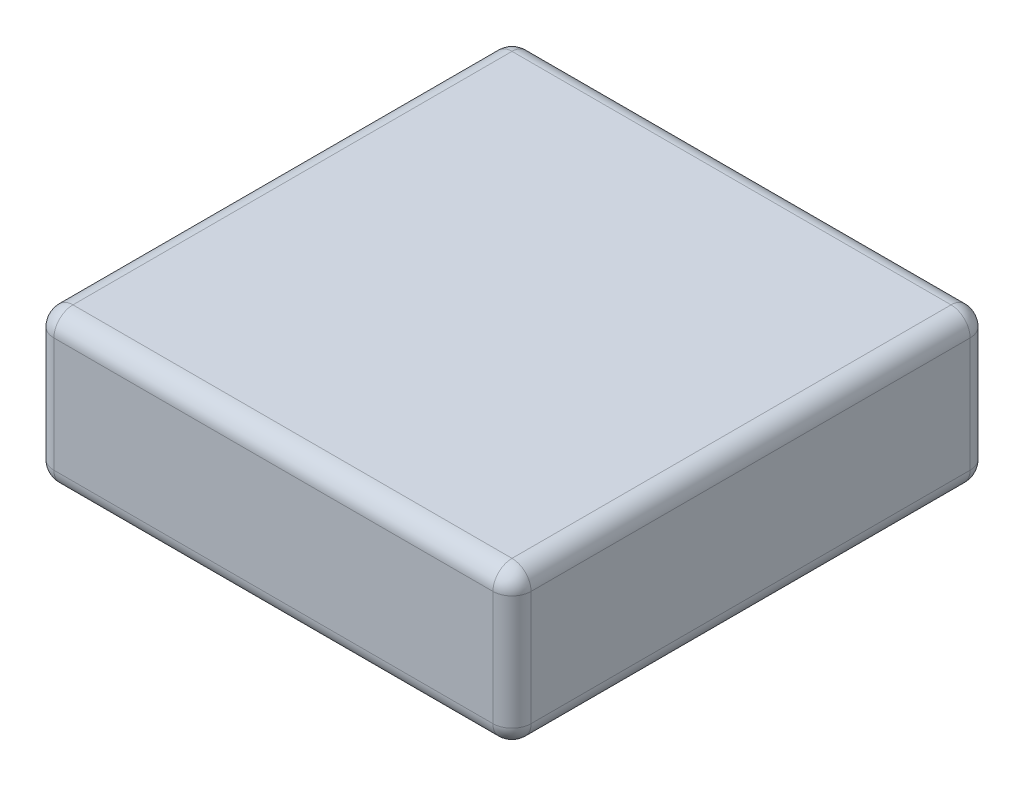
ISO-10303-21;
HEADER;
FILE_DESCRIPTION(('STEP AP214'),'2;1');
FILE_NAME('part.step','',(''),(''),'','','');
FILE_SCHEMA(('AUTOMOTIVE_DESIGN { 1 0 10303 214 1 1 1 1 }'));
ENDSEC;
DATA;
#1=APPLICATION_CONTEXT('core data for automotive mechanical design processes');
#2=APPLICATION_PROTOCOL_DEFINITION('international standard','automotive_design',2000,#1);
#3=PRODUCT_CONTEXT('',#1,'mechanical');
#4=PRODUCT('Part','Part','',(#3));
#5=PRODUCT_RELATED_PRODUCT_CATEGORY('part','',(#4));
#6=PRODUCT_DEFINITION_FORMATION('','',#4);
#7=PRODUCT_DEFINITION_CONTEXT('part definition',#1,'design');
#8=PRODUCT_DEFINITION('design','',#6,#7);
#9=PRODUCT_DEFINITION_SHAPE('','',#8);
#10=(LENGTH_UNIT() NAMED_UNIT(*) SI_UNIT(.MILLI.,.METRE.));
#11=(NAMED_UNIT(*) PLANE_ANGLE_UNIT() SI_UNIT($,.RADIAN.));
#12=(NAMED_UNIT(*) SI_UNIT($,.STERADIAN.) SOLID_ANGLE_UNIT());
#13=UNCERTAINTY_MEASURE_WITH_UNIT(LENGTH_MEASURE(1.E-05),#10,'distance_accuracy_value','');
#14=(GEOMETRIC_REPRESENTATION_CONTEXT(3) GLOBAL_UNCERTAINTY_ASSIGNED_CONTEXT((#13)) GLOBAL_UNIT_ASSIGNED_CONTEXT((#10,
#11,#12)) REPRESENTATION_CONTEXT('',''));
#15=CARTESIAN_POINT('',(0.,0.,0.));
#16=DIRECTION('',(0.,0.,1.));
#17=DIRECTION('',(1.,0.,0.));
#18=AXIS2_PLACEMENT_3D('',#15,#16,#17);
#19=CARTESIAN_POINT('',(-12.5,8.,12.5));
#20=DIRECTION('',(1.,0.,0.));
#21=DIRECTION('',(0.,0.,-1.));
#22=AXIS2_PLACEMENT_3D('',#19,#20,#21);
#23=PLANE('',#22);
#24=DIRECTION('',(0.,-1.,0.));
#25=VECTOR('',#24,1.);
#26=CARTESIAN_POINT('',(-12.5,8.,-11.5));
#27=LINE('',#26,#25);
#28=CARTESIAN_POINT('',(-12.5,7.,-11.5));
#29=VERTEX_POINT('',#28);
#30=CARTESIAN_POINT('',(-12.5,1.,-11.5));
#31=VERTEX_POINT('',#30);
#32=EDGE_CURVE('E169',#29,#31,#27,.T.);
#33=ORIENTED_EDGE('',*,*,#32,.T.);
#34=DIRECTION('',(0.,0.,1.));
#35=VECTOR('',#34,1.);
#36=CARTESIAN_POINT('',(-12.5,1.,12.5));
#37=LINE('',#36,#35);
#38=CARTESIAN_POINT('',(-12.5,1.,11.5));
#39=VERTEX_POINT('',#38);
#40=EDGE_CURVE('E174',#31,#39,#37,.T.);
#41=ORIENTED_EDGE('',*,*,#40,.T.);
#42=DIRECTION('',(0.,-1.,0.));
#43=VECTOR('',#42,1.);
#44=CARTESIAN_POINT('',(-12.5,8.,11.5));
#45=LINE('',#44,#43);
#46=CARTESIAN_POINT('',(-12.5,7.,11.5));
#47=VERTEX_POINT('',#46);
#48=EDGE_CURVE('E171',#39,#47,#45,.F.);
#49=ORIENTED_EDGE('',*,*,#48,.T.);
#50=DIRECTION('',(0.,0.,1.));
#51=VECTOR('',#50,1.);
#52=CARTESIAN_POINT('',(-12.5,7.,-12.5));
#53=LINE('',#52,#51);
#54=EDGE_CURVE('E167',#47,#29,#53,.F.);
#55=ORIENTED_EDGE('',*,*,#54,.T.);
#56=EDGE_LOOP('',(#33,#41,#49,#55));
#57=FACE_BOUND('',#56,.T.);
#58=ADVANCED_FACE('F36',(#57),#23,.F.);
#59=CARTESIAN_POINT('',(12.5,8.,12.5));
#60=DIRECTION('',(0.,0.,-1.));
#61=DIRECTION('',(-1.,0.,0.));
#62=AXIS2_PLACEMENT_3D('',#59,#60,#61);
#63=PLANE('',#62);
#64=DIRECTION('',(0.,-1.,0.));
#65=VECTOR('',#64,1.);
#66=CARTESIAN_POINT('',(-11.5,8.,12.5));
#67=LINE('',#66,#65);
#68=CARTESIAN_POINT('',(-11.5,7.,12.5));
#69=VERTEX_POINT('',#68);
#70=CARTESIAN_POINT('',(-11.5,1.,12.5));
#71=VERTEX_POINT('',#70);
#72=EDGE_CURVE('E135',#69,#71,#67,.T.);
#73=ORIENTED_EDGE('',*,*,#72,.T.);
#74=DIRECTION('',(1.,0.,0.));
#75=VECTOR('',#74,1.);
#76=CARTESIAN_POINT('',(12.5,1.,12.5));
#77=LINE('',#76,#75);
#78=CARTESIAN_POINT('',(11.5,1.,12.5));
#79=VERTEX_POINT('',#78);
#80=EDGE_CURVE('E131',#71,#79,#77,.T.);
#81=ORIENTED_EDGE('',*,*,#80,.T.);
#82=DIRECTION('',(0.,-1.,0.));
#83=VECTOR('',#82,1.);
#84=CARTESIAN_POINT('',(11.5,8.,12.5));
#85=LINE('',#84,#83);
#86=CARTESIAN_POINT('',(11.5,7.,12.5));
#87=VERTEX_POINT('',#86);
#88=EDGE_CURVE('E123',#79,#87,#85,.F.);
#89=ORIENTED_EDGE('',*,*,#88,.T.);
#90=DIRECTION('',(1.,0.,0.));
#91=VECTOR('',#90,1.);
#92=CARTESIAN_POINT('',(-12.5,7.,12.5));
#93=LINE('',#92,#91);
#94=EDGE_CURVE('E128',#87,#69,#93,.F.);
#95=ORIENTED_EDGE('',*,*,#94,.T.);
#96=EDGE_LOOP('',(#73,#81,#89,#95));
#97=FACE_BOUND('',#96,.T.);
#98=ADVANCED_FACE('F126',(#97),#63,.F.);
#99=CARTESIAN_POINT('',(12.5,8.,12.5));
#100=DIRECTION('',(-1.,0.,0.));
#101=DIRECTION('',(0.,0.,1.));
#102=AXIS2_PLACEMENT_3D('',#99,#100,#101);
#103=PLANE('',#102);
#104=DIRECTION('',(0.,-1.,0.));
#105=VECTOR('',#104,1.);
#106=CARTESIAN_POINT('',(12.5,8.,11.5));
#107=LINE('',#106,#105);
#108=CARTESIAN_POINT('',(12.5,7.,11.5));
#109=VERTEX_POINT('',#108);
#110=CARTESIAN_POINT('',(12.5,1.,11.5));
#111=VERTEX_POINT('',#110);
#112=EDGE_CURVE('E143',#109,#111,#107,.T.);
#113=ORIENTED_EDGE('',*,*,#112,.T.);
#114=DIRECTION('',(0.,0.,-1.));
#115=VECTOR('',#114,1.);
#116=CARTESIAN_POINT('',(12.5,1.,12.5));
#117=LINE('',#116,#115);
#118=CARTESIAN_POINT('',(12.5,1.,-11.5));
#119=VERTEX_POINT('',#118);
#120=EDGE_CURVE('E190',#111,#119,#117,.T.);
#121=ORIENTED_EDGE('',*,*,#120,.T.);
#122=DIRECTION('',(0.,-1.,0.));
#123=VECTOR('',#122,1.);
#124=CARTESIAN_POINT('',(12.5,8.,-11.5));
#125=LINE('',#124,#123);
#126=CARTESIAN_POINT('',(12.5,7.,-11.5));
#127=VERTEX_POINT('',#126);
#128=EDGE_CURVE('E187',#119,#127,#125,.F.);
#129=ORIENTED_EDGE('',*,*,#128,.T.);
#130=DIRECTION('',(0.,0.,-1.));
#131=VECTOR('',#130,1.);
#132=CARTESIAN_POINT('',(12.5,7.,12.5));
#133=LINE('',#132,#131);
#134=EDGE_CURVE('E185',#127,#109,#133,.F.);
#135=ORIENTED_EDGE('',*,*,#134,.T.);
#136=EDGE_LOOP('',(#113,#121,#129,#135));
#137=FACE_BOUND('',#136,.T.);
#138=ADVANCED_FACE('F299',(#137),#103,.F.);
#139=CARTESIAN_POINT('',(12.5,8.,-12.5));
#140=DIRECTION('',(0.,0.,1.));
#141=DIRECTION('',(1.,0.,0.));
#142=AXIS2_PLACEMENT_3D('',#139,#140,#141);
#143=PLANE('',#142);
#144=DIRECTION('',(0.,-1.,0.));
#145=VECTOR('',#144,1.);
#146=CARTESIAN_POINT('',(11.5,8.,-12.5));
#147=LINE('',#146,#145);
#148=CARTESIAN_POINT('',(11.5,7.,-12.5));
#149=VERTEX_POINT('',#148);
#150=CARTESIAN_POINT('',(11.5,1.,-12.5));
#151=VERTEX_POINT('',#150);
#152=EDGE_CURVE('E178',#149,#151,#147,.T.);
#153=ORIENTED_EDGE('',*,*,#152,.T.);
#154=DIRECTION('',(-1.,0.,0.));
#155=VECTOR('',#154,1.);
#156=CARTESIAN_POINT('',(12.5,1.,-12.5));
#157=LINE('',#156,#155);
#158=CARTESIAN_POINT('',(-11.5,1.,-12.5));
#159=VERTEX_POINT('',#158);
#160=EDGE_CURVE('E183',#151,#159,#157,.T.);
#161=ORIENTED_EDGE('',*,*,#160,.T.);
#162=DIRECTION('',(0.,-1.,0.));
#163=VECTOR('',#162,1.);
#164=CARTESIAN_POINT('',(-11.5,8.,-12.5));
#165=LINE('',#164,#163);
#166=CARTESIAN_POINT('',(-11.5,7.,-12.5));
#167=VERTEX_POINT('',#166);
#168=EDGE_CURVE('E180',#159,#167,#165,.F.);
#169=ORIENTED_EDGE('',*,*,#168,.T.);
#170=DIRECTION('',(-1.,0.,0.));
#171=VECTOR('',#170,1.);
#172=CARTESIAN_POINT('',(12.5,7.,-12.5));
#173=LINE('',#172,#171);
#174=EDGE_CURVE('E176',#167,#149,#173,.F.);
#175=ORIENTED_EDGE('',*,*,#174,.T.);
#176=EDGE_LOOP('',(#153,#161,#169,#175));
#177=FACE_BOUND('',#176,.T.);
#178=ADVANCED_FACE('F276',(#177),#143,.F.);
#179=CARTESIAN_POINT('',(0.,8.,0.));
#180=DIRECTION('',(0.,1.,0.));
#181=DIRECTION('',(0.,0.,1.));
#182=AXIS2_PLACEMENT_3D('',#179,#180,#181);
#183=PLANE('',#182);
#184=DIRECTION('',(0.,0.,-1.));
#185=VECTOR('',#184,1.);
#186=CARTESIAN_POINT('',(11.5,8.,-12.5));
#187=LINE('',#186,#185);
#188=CARTESIAN_POINT('',(11.5,8.,11.5));
#189=VERTEX_POINT('',#188);
#190=CARTESIAN_POINT('',(11.5,8.,-11.5));
#191=VERTEX_POINT('',#190);
#192=EDGE_CURVE('E45',#189,#191,#187,.T.);
#193=ORIENTED_EDGE('',*,*,#192,.T.);
#194=DIRECTION('',(-1.,0.,0.));
#195=VECTOR('',#194,1.);
#196=CARTESIAN_POINT('',(-12.5,8.,-11.5));
#197=LINE('',#196,#195);
#198=CARTESIAN_POINT('',(-11.5,8.,-11.5));
#199=VERTEX_POINT('',#198);
#200=EDGE_CURVE('E11',#191,#199,#197,.T.);
#201=ORIENTED_EDGE('',*,*,#200,.T.);
#202=DIRECTION('',(0.,0.,1.));
#203=VECTOR('',#202,1.);
#204=CARTESIAN_POINT('',(-11.5,8.,12.5));
#205=LINE('',#204,#203);
#206=CARTESIAN_POINT('',(-11.5,8.,11.5));
#207=VERTEX_POINT('',#206);
#208=EDGE_CURVE('E201',#199,#207,#205,.T.);
#209=ORIENTED_EDGE('',*,*,#208,.T.);
#210=DIRECTION('',(1.,0.,0.));
#211=VECTOR('',#210,1.);
#212=CARTESIAN_POINT('',(12.5,8.,11.5));
#213=LINE('',#212,#211);
#214=EDGE_CURVE('E56',#207,#189,#213,.T.);
#215=ORIENTED_EDGE('',*,*,#214,.T.);
#216=EDGE_LOOP('',(#193,#201,#209,#215));
#217=FACE_BOUND('',#216,.T.);
#218=ADVANCED_FACE('F306',(#217),#183,.T.);
#219=CARTESIAN_POINT('',(0.,0.,0.));
#220=DIRECTION('',(0.,1.,0.));
#221=DIRECTION('',(0.,0.,1.));
#222=AXIS2_PLACEMENT_3D('',#219,#220,#221);
#223=PLANE('',#222);
#224=DIRECTION('',(0.,0.,-1.));
#225=VECTOR('',#224,1.);
#226=CARTESIAN_POINT('',(11.5,0.,0.));
#227=LINE('',#226,#225);
#228=CARTESIAN_POINT('',(11.5,0.,-11.5));
#229=VERTEX_POINT('',#228);
#230=CARTESIAN_POINT('',(11.5,0.,11.5));
#231=VERTEX_POINT('',#230);
#232=EDGE_CURVE('E196',#229,#231,#227,.F.);
#233=ORIENTED_EDGE('',*,*,#232,.T.);
#234=DIRECTION('',(1.,0.,0.));
#235=VECTOR('',#234,1.);
#236=CARTESIAN_POINT('',(0.,0.,11.5));
#237=LINE('',#236,#235);
#238=CARTESIAN_POINT('',(-11.5,0.,11.5));
#239=VERTEX_POINT('',#238);
#240=EDGE_CURVE('E198',#231,#239,#237,.F.);
#241=ORIENTED_EDGE('',*,*,#240,.T.);
#242=DIRECTION('',(0.,0.,1.));
#243=VECTOR('',#242,1.);
#244=CARTESIAN_POINT('',(-11.5,0.,0.));
#245=LINE('',#244,#243);
#246=CARTESIAN_POINT('',(-11.5,0.,-11.5));
#247=VERTEX_POINT('',#246);
#248=EDGE_CURVE('E192',#239,#247,#245,.F.);
#249=ORIENTED_EDGE('',*,*,#248,.T.);
#250=DIRECTION('',(-1.,0.,0.));
#251=VECTOR('',#250,1.);
#252=CARTESIAN_POINT('',(0.,0.,-11.5));
#253=LINE('',#252,#251);
#254=EDGE_CURVE('E194',#247,#229,#253,.F.);
#255=ORIENTED_EDGE('',*,*,#254,.T.);
#256=EDGE_LOOP('',(#233,#241,#249,#255));
#257=FACE_BOUND('',#256,.T.);
#258=ADVANCED_FACE('F267',(#257),#223,.F.);
#259=CARTESIAN_POINT('',(11.5,8.,-11.5));
#260=DIRECTION('',(0.,-1.,0.));
#261=DIRECTION('',(0.,0.,-1.));
#262=AXIS2_PLACEMENT_3D('',#259,#260,#261);
#263=CYLINDRICAL_SURFACE('',#262,1.);
#264=CARTESIAN_POINT('',(11.5,7.,-11.5));
#265=DIRECTION('',(0.,1.,0.));
#266=DIRECTION('',(0.,0.,1.));
#267=AXIS2_PLACEMENT_3D('',#264,#265,#266);
#268=CIRCLE('',#267,1.);
#269=EDGE_CURVE('E40',#127,#149,#268,.T.);
#270=ORIENTED_EDGE('',*,*,#269,.F.);
#271=ORIENTED_EDGE('',*,*,#128,.F.);
#272=CARTESIAN_POINT('',(11.5,1.,-11.5));
#273=DIRECTION('',(0.,-1.,0.));
#274=DIRECTION('',(0.,0.,-1.));
#275=AXIS2_PLACEMENT_3D('',#272,#273,#274);
#276=CIRCLE('',#275,1.);
#277=EDGE_CURVE('E163',#151,#119,#276,.T.);
#278=ORIENTED_EDGE('',*,*,#277,.F.);
#279=ORIENTED_EDGE('',*,*,#152,.F.);
#280=EDGE_LOOP('',(#270,#271,#278,#279));
#281=FACE_BOUND('',#280,.T.);
#282=ADVANCED_FACE('F38',(#281),#263,.T.);
#283=CARTESIAN_POINT('',(11.5,7.,-11.5));
#284=DIRECTION('',(0.,0.,1.));
#285=DIRECTION('',(1.,0.,0.));
#286=AXIS2_PLACEMENT_3D('',#283,#284,#285);
#287=SPHERICAL_SURFACE('',#286,1.);
#288=CARTESIAN_POINT('',(11.5,7.,-11.5));
#289=DIRECTION('',(0.,0.,-1.));
#290=DIRECTION('',(-1.,0.,0.));
#291=AXIS2_PLACEMENT_3D('',#288,#289,#290);
#292=CIRCLE('',#291,1.);
#293=EDGE_CURVE('E246',#127,#191,#292,.F.);
#294=ORIENTED_EDGE('',*,*,#293,.F.);
#295=ORIENTED_EDGE('',*,*,#269,.T.);
#296=CARTESIAN_POINT('',(11.5,7.,-11.5));
#297=DIRECTION('',(1.,0.,0.));
#298=DIRECTION('',(0.,0.,-1.));
#299=AXIS2_PLACEMENT_3D('',#296,#297,#298);
#300=CIRCLE('',#299,1.);
#301=EDGE_CURVE('E248',#191,#149,#300,.F.);
#302=ORIENTED_EDGE('',*,*,#301,.F.);
#303=EDGE_LOOP('',(#294,#295,#302));
#304=FACE_BOUND('',#303,.T.);
#305=ADVANCED_FACE('F294',(#304),#287,.T.);
#306=CARTESIAN_POINT('',(11.5,1.,-11.5));
#307=DIRECTION('',(0.,0.,1.));
#308=DIRECTION('',(1.,0.,0.));
#309=AXIS2_PLACEMENT_3D('',#306,#307,#308);
#310=SPHERICAL_SURFACE('',#309,1.);
#311=CARTESIAN_POINT('',(11.5,1.,-11.5));
#312=DIRECTION('',(1.,0.,0.));
#313=DIRECTION('',(0.,0.,-1.));
#314=AXIS2_PLACEMENT_3D('',#311,#312,#313);
#315=CIRCLE('',#314,1.);
#316=EDGE_CURVE('E240',#151,#229,#315,.F.);
#317=ORIENTED_EDGE('',*,*,#316,.F.);
#318=ORIENTED_EDGE('',*,*,#277,.T.);
#319=CARTESIAN_POINT('',(11.5,1.,-11.5));
#320=DIRECTION('',(0.,0.,-1.));
#321=DIRECTION('',(-1.,0.,0.));
#322=AXIS2_PLACEMENT_3D('',#319,#320,#321);
#323=CIRCLE('',#322,1.);
#324=EDGE_CURVE('E243',#229,#119,#323,.F.);
#325=ORIENTED_EDGE('',*,*,#324,.F.);
#326=EDGE_LOOP('',(#317,#318,#325));
#327=FACE_BOUND('',#326,.T.);
#328=ADVANCED_FACE('F255',(#327),#310,.T.);
#329=CARTESIAN_POINT('',(0.,7.,-11.5));
#330=DIRECTION('',(1.,0.,0.));
#331=DIRECTION('',(0.,0.,-1.));
#332=AXIS2_PLACEMENT_3D('',#329,#330,#331);
#333=CYLINDRICAL_SURFACE('',#332,1.);
#334=ORIENTED_EDGE('',*,*,#301,.T.);
#335=ORIENTED_EDGE('',*,*,#174,.F.);
#336=CARTESIAN_POINT('',(-11.5,7.,-11.5));
#337=DIRECTION('',(-1.,0.,0.));
#338=DIRECTION('',(0.,0.,1.));
#339=AXIS2_PLACEMENT_3D('',#336,#337,#338);
#340=CIRCLE('',#339,1.);
#341=EDGE_CURVE('E235',#199,#167,#340,.T.);
#342=ORIENTED_EDGE('',*,*,#341,.F.);
#343=ORIENTED_EDGE('',*,*,#200,.F.);
#344=EDGE_LOOP('',(#334,#335,#342,#343));
#345=FACE_BOUND('',#344,.T.);
#346=ADVANCED_FACE('F288',(#345),#333,.T.);
#347=CARTESIAN_POINT('',(11.5,7.,0.));
#348=DIRECTION('',(0.,0.,1.));
#349=DIRECTION('',(1.,0.,0.));
#350=AXIS2_PLACEMENT_3D('',#347,#348,#349);
#351=CYLINDRICAL_SURFACE('',#350,1.);
#352=ORIENTED_EDGE('',*,*,#293,.T.);
#353=ORIENTED_EDGE('',*,*,#192,.F.);
#354=CARTESIAN_POINT('',(11.5,7.,11.5));
#355=DIRECTION('',(0.,0.,1.));
#356=DIRECTION('',(1.,0.,0.));
#357=AXIS2_PLACEMENT_3D('',#354,#355,#356);
#358=CIRCLE('',#357,1.);
#359=EDGE_CURVE('E147',#109,#189,#358,.T.);
#360=ORIENTED_EDGE('',*,*,#359,.F.);
#361=ORIENTED_EDGE('',*,*,#134,.F.);
#362=EDGE_LOOP('',(#352,#353,#360,#361));
#363=FACE_BOUND('',#362,.T.);
#364=ADVANCED_FACE('F297',(#363),#351,.T.);
#365=CARTESIAN_POINT('',(11.5,8.,11.5));
#366=DIRECTION('',(0.,-1.,0.));
#367=DIRECTION('',(0.,0.,-1.));
#368=AXIS2_PLACEMENT_3D('',#365,#366,#367);
#369=CYLINDRICAL_SURFACE('',#368,1.);
#370=CARTESIAN_POINT('',(11.5,1.,11.5));
#371=DIRECTION('',(0.,-1.,0.));
#372=DIRECTION('',(0.,0.,-1.));
#373=AXIS2_PLACEMENT_3D('',#370,#371,#372);
#374=CIRCLE('',#373,1.);
#375=EDGE_CURVE('E148',#111,#79,#374,.T.);
#376=ORIENTED_EDGE('',*,*,#375,.F.);
#377=ORIENTED_EDGE('',*,*,#112,.F.);
#378=CARTESIAN_POINT('',(11.5,7.,11.5));
#379=DIRECTION('',(0.,1.,0.));
#380=DIRECTION('',(0.,0.,1.));
#381=AXIS2_PLACEMENT_3D('',#378,#379,#380);
#382=CIRCLE('',#381,1.);
#383=EDGE_CURVE('E139',#87,#109,#382,.T.);
#384=ORIENTED_EDGE('',*,*,#383,.F.);
#385=ORIENTED_EDGE('',*,*,#88,.F.);
#386=EDGE_LOOP('',(#376,#377,#384,#385));
#387=FACE_BOUND('',#386,.T.);
#388=ADVANCED_FACE('F141',(#387),#369,.T.);
#389=CARTESIAN_POINT('',(11.5,1.,12.5));
#390=DIRECTION('',(0.,0.,-1.));
#391=DIRECTION('',(-1.,0.,0.));
#392=AXIS2_PLACEMENT_3D('',#389,#390,#391);
#393=CYLINDRICAL_SURFACE('',#392,1.);
#394=ORIENTED_EDGE('',*,*,#324,.T.);
#395=ORIENTED_EDGE('',*,*,#120,.F.);
#396=CARTESIAN_POINT('',(11.5,1.,11.5));
#397=DIRECTION('',(0.,0.,1.));
#398=DIRECTION('',(1.,0.,0.));
#399=AXIS2_PLACEMENT_3D('',#396,#397,#398);
#400=CIRCLE('',#399,1.);
#401=EDGE_CURVE('E231',#231,#111,#400,.T.);
#402=ORIENTED_EDGE('',*,*,#401,.F.);
#403=ORIENTED_EDGE('',*,*,#232,.F.);
#404=EDGE_LOOP('',(#394,#395,#402,#403));
#405=FACE_BOUND('',#404,.T.);
#406=ADVANCED_FACE('F263',(#405),#393,.T.);
#407=CARTESIAN_POINT('',(12.5,1.,-11.5));
#408=DIRECTION('',(-1.,0.,0.));
#409=DIRECTION('',(0.,0.,1.));
#410=AXIS2_PLACEMENT_3D('',#407,#408,#409);
#411=CYLINDRICAL_SURFACE('',#410,1.);
#412=ORIENTED_EDGE('',*,*,#316,.T.);
#413=ORIENTED_EDGE('',*,*,#254,.F.);
#414=CARTESIAN_POINT('',(-11.5,1.,-11.5));
#415=DIRECTION('',(-1.,0.,0.));
#416=DIRECTION('',(0.,0.,1.));
#417=AXIS2_PLACEMENT_3D('',#414,#415,#416);
#418=CIRCLE('',#417,1.);
#419=EDGE_CURVE('E228',#159,#247,#418,.T.);
#420=ORIENTED_EDGE('',*,*,#419,.F.);
#421=ORIENTED_EDGE('',*,*,#160,.F.);
#422=EDGE_LOOP('',(#412,#413,#420,#421));
#423=FACE_BOUND('',#422,.T.);
#424=ADVANCED_FACE('F273',(#423),#411,.T.);
#425=CARTESIAN_POINT('',(-11.5,8.,-11.5));
#426=DIRECTION('',(0.,-1.,0.));
#427=DIRECTION('',(0.,0.,-1.));
#428=AXIS2_PLACEMENT_3D('',#425,#426,#427);
#429=CYLINDRICAL_SURFACE('',#428,1.);
#430=CARTESIAN_POINT('',(-11.5,7.,-11.5));
#431=DIRECTION('',(0.,1.,0.));
#432=DIRECTION('',(0.,0.,1.));
#433=AXIS2_PLACEMENT_3D('',#430,#431,#432);
#434=CIRCLE('',#433,1.);
#435=EDGE_CURVE('E237',#167,#29,#434,.T.);
#436=ORIENTED_EDGE('',*,*,#435,.F.);
#437=ORIENTED_EDGE('',*,*,#168,.F.);
#438=CARTESIAN_POINT('',(-11.5,1.,-11.5));
#439=DIRECTION('',(0.,-1.,0.));
#440=DIRECTION('',(0.,0.,-1.));
#441=AXIS2_PLACEMENT_3D('',#438,#439,#440);
#442=CIRCLE('',#441,1.);
#443=EDGE_CURVE('E225',#31,#159,#442,.T.);
#444=ORIENTED_EDGE('',*,*,#443,.F.);
#445=ORIENTED_EDGE('',*,*,#32,.F.);
#446=EDGE_LOOP('',(#436,#437,#444,#445));
#447=FACE_BOUND('',#446,.T.);
#448=ADVANCED_FACE('F280',(#447),#429,.T.);
#449=CARTESIAN_POINT('',(-11.5,7.,-11.5));
#450=DIRECTION('',(0.,0.,1.));
#451=DIRECTION('',(1.,0.,0.));
#452=AXIS2_PLACEMENT_3D('',#449,#450,#451);
#453=SPHERICAL_SURFACE('',#452,1.);
#454=ORIENTED_EDGE('',*,*,#341,.T.);
#455=ORIENTED_EDGE('',*,*,#435,.T.);
#456=CARTESIAN_POINT('',(-11.5,7.,-11.5));
#457=DIRECTION('',(0.,0.,-1.));
#458=DIRECTION('',(-1.,0.,0.));
#459=AXIS2_PLACEMENT_3D('',#456,#457,#458);
#460=CIRCLE('',#459,1.);
#461=EDGE_CURVE('E154',#199,#29,#460,.F.);
#462=ORIENTED_EDGE('',*,*,#461,.F.);
#463=EDGE_LOOP('',(#454,#455,#462));
#464=FACE_BOUND('',#463,.T.);
#465=ADVANCED_FACE('F351',(#464),#453,.T.);
#466=CARTESIAN_POINT('',(11.5,7.,11.5));
#467=DIRECTION('',(0.,0.,1.));
#468=DIRECTION('',(1.,0.,0.));
#469=AXIS2_PLACEMENT_3D('',#466,#467,#468);
#470=SPHERICAL_SURFACE('',#469,1.);
#471=ORIENTED_EDGE('',*,*,#383,.T.);
#472=ORIENTED_EDGE('',*,*,#359,.T.);
#473=CARTESIAN_POINT('',(11.5,7.,11.5));
#474=DIRECTION('',(1.,0.,0.));
#475=DIRECTION('',(0.,0.,-1.));
#476=AXIS2_PLACEMENT_3D('',#473,#474,#475);
#477=CIRCLE('',#476,1.);
#478=EDGE_CURVE('E151',#87,#189,#477,.F.);
#479=ORIENTED_EDGE('',*,*,#478,.F.);
#480=EDGE_LOOP('',(#471,#472,#479));
#481=FACE_BOUND('',#480,.T.);
#482=ADVANCED_FACE('F152',(#481),#470,.T.);
#483=CARTESIAN_POINT('',(11.5,1.,11.5));
#484=DIRECTION('',(0.,0.,1.));
#485=DIRECTION('',(1.,0.,0.));
#486=AXIS2_PLACEMENT_3D('',#483,#484,#485);
#487=SPHERICAL_SURFACE('',#486,1.);
#488=ORIENTED_EDGE('',*,*,#401,.T.);
#489=ORIENTED_EDGE('',*,*,#375,.T.);
#490=CARTESIAN_POINT('',(11.5,1.,11.5));
#491=DIRECTION('',(1.,0.,0.));
#492=DIRECTION('',(0.,0.,-1.));
#493=AXIS2_PLACEMENT_3D('',#490,#491,#492);
#494=CIRCLE('',#493,1.);
#495=EDGE_CURVE('E155',#231,#79,#494,.F.);
#496=ORIENTED_EDGE('',*,*,#495,.F.);
#497=EDGE_LOOP('',(#488,#489,#496));
#498=FACE_BOUND('',#497,.T.);
#499=ADVANCED_FACE('F344',(#498),#487,.T.);
#500=CARTESIAN_POINT('',(-11.5,1.,-11.5));
#501=DIRECTION('',(0.,0.,1.));
#502=DIRECTION('',(1.,0.,0.));
#503=AXIS2_PLACEMENT_3D('',#500,#501,#502);
#504=SPHERICAL_SURFACE('',#503,1.);
#505=ORIENTED_EDGE('',*,*,#443,.T.);
#506=ORIENTED_EDGE('',*,*,#419,.T.);
#507=CARTESIAN_POINT('',(-11.5,1.,-11.5));
#508=DIRECTION('',(0.,0.,-1.));
#509=DIRECTION('',(-1.,0.,0.));
#510=AXIS2_PLACEMENT_3D('',#507,#508,#509);
#511=CIRCLE('',#510,1.);
#512=EDGE_CURVE('E218',#31,#247,#511,.F.);
#513=ORIENTED_EDGE('',*,*,#512,.F.);
#514=EDGE_LOOP('',(#505,#506,#513));
#515=FACE_BOUND('',#514,.T.);
#516=ADVANCED_FACE('F340',(#515),#504,.T.);
#517=CARTESIAN_POINT('',(-11.5,7.,0.));
#518=DIRECTION('',(0.,0.,-1.));
#519=DIRECTION('',(-1.,0.,0.));
#520=AXIS2_PLACEMENT_3D('',#517,#518,#519);
#521=CYLINDRICAL_SURFACE('',#520,1.);
#522=ORIENTED_EDGE('',*,*,#461,.T.);
#523=ORIENTED_EDGE('',*,*,#54,.F.);
#524=CARTESIAN_POINT('',(-11.5,7.,11.5));
#525=DIRECTION('',(0.,0.,1.));
#526=DIRECTION('',(1.,0.,0.));
#527=AXIS2_PLACEMENT_3D('',#524,#525,#526);
#528=CIRCLE('',#527,1.);
#529=EDGE_CURVE('E215',#207,#47,#528,.T.);
#530=ORIENTED_EDGE('',*,*,#529,.F.);
#531=ORIENTED_EDGE('',*,*,#208,.F.);
#532=EDGE_LOOP('',(#522,#523,#530,#531));
#533=FACE_BOUND('',#532,.T.);
#534=ADVANCED_FACE('F337',(#533),#521,.T.);
#535=CARTESIAN_POINT('',(0.,7.,11.5));
#536=DIRECTION('',(-1.,0.,0.));
#537=DIRECTION('',(0.,0.,1.));
#538=AXIS2_PLACEMENT_3D('',#535,#536,#537);
#539=CYLINDRICAL_SURFACE('',#538,1.);
#540=ORIENTED_EDGE('',*,*,#478,.T.);
#541=ORIENTED_EDGE('',*,*,#214,.F.);
#542=CARTESIAN_POINT('',(-11.5,7.,11.5));
#543=DIRECTION('',(-1.,0.,0.));
#544=DIRECTION('',(0.,0.,1.));
#545=AXIS2_PLACEMENT_3D('',#542,#543,#544);
#546=CIRCLE('',#545,1.);
#547=EDGE_CURVE('E159',#69,#207,#546,.T.);
#548=ORIENTED_EDGE('',*,*,#547,.F.);
#549=ORIENTED_EDGE('',*,*,#94,.F.);
#550=EDGE_LOOP('',(#540,#541,#548,#549));
#551=FACE_BOUND('',#550,.T.);
#552=ADVANCED_FACE('F157',(#551),#539,.T.);
#553=CARTESIAN_POINT('',(12.5,1.,11.5));
#554=DIRECTION('',(1.,0.,0.));
#555=DIRECTION('',(0.,0.,-1.));
#556=AXIS2_PLACEMENT_3D('',#553,#554,#555);
#557=CYLINDRICAL_SURFACE('',#556,1.);
#558=ORIENTED_EDGE('',*,*,#495,.T.);
#559=ORIENTED_EDGE('',*,*,#80,.F.);
#560=CARTESIAN_POINT('',(-11.5,1.,11.5));
#561=DIRECTION('',(-1.,0.,0.));
#562=DIRECTION('',(0.,0.,1.));
#563=AXIS2_PLACEMENT_3D('',#560,#561,#562);
#564=CIRCLE('',#563,1.);
#565=EDGE_CURVE('E211',#239,#71,#564,.T.);
#566=ORIENTED_EDGE('',*,*,#565,.F.);
#567=ORIENTED_EDGE('',*,*,#240,.F.);
#568=EDGE_LOOP('',(#558,#559,#566,#567));
#569=FACE_BOUND('',#568,.T.);
#570=ADVANCED_FACE('F330',(#569),#557,.T.);
#571=CARTESIAN_POINT('',(-11.5,1.,12.5));
#572=DIRECTION('',(0.,0.,1.));
#573=DIRECTION('',(1.,0.,0.));
#574=AXIS2_PLACEMENT_3D('',#571,#572,#573);
#575=CYLINDRICAL_SURFACE('',#574,1.);
#576=ORIENTED_EDGE('',*,*,#512,.T.);
#577=ORIENTED_EDGE('',*,*,#248,.F.);
#578=CARTESIAN_POINT('',(-11.5,1.,11.5));
#579=DIRECTION('',(0.,0.,1.));
#580=DIRECTION('',(1.,0.,0.));
#581=AXIS2_PLACEMENT_3D('',#578,#579,#580);
#582=CIRCLE('',#581,1.);
#583=EDGE_CURVE('E209',#39,#239,#582,.T.);
#584=ORIENTED_EDGE('',*,*,#583,.F.);
#585=ORIENTED_EDGE('',*,*,#40,.F.);
#586=EDGE_LOOP('',(#576,#577,#584,#585));
#587=FACE_BOUND('',#586,.T.);
#588=ADVANCED_FACE('F326',(#587),#575,.T.);
#589=CARTESIAN_POINT('',(-11.5,7.,11.5));
#590=DIRECTION('',(0.,0.,1.));
#591=DIRECTION('',(1.,0.,0.));
#592=AXIS2_PLACEMENT_3D('',#589,#590,#591);
#593=SPHERICAL_SURFACE('',#592,1.);
#594=ORIENTED_EDGE('',*,*,#547,.T.);
#595=ORIENTED_EDGE('',*,*,#529,.T.);
#596=CARTESIAN_POINT('',(-11.5,7.,11.5));
#597=DIRECTION('',(0.,1.,0.));
#598=DIRECTION('',(0.,0.,1.));
#599=AXIS2_PLACEMENT_3D('',#596,#597,#598);
#600=CIRCLE('',#599,1.);
#601=EDGE_CURVE('E207',#69,#47,#600,.F.);
#602=ORIENTED_EDGE('',*,*,#601,.F.);
#603=EDGE_LOOP('',(#594,#595,#602));
#604=FACE_BOUND('',#603,.T.);
#605=ADVANCED_FACE('F322',(#604),#593,.T.);
#606=CARTESIAN_POINT('',(-11.5,1.,11.5));
#607=DIRECTION('',(0.,0.,1.));
#608=DIRECTION('',(1.,0.,0.));
#609=AXIS2_PLACEMENT_3D('',#606,#607,#608);
#610=SPHERICAL_SURFACE('',#609,1.);
#611=ORIENTED_EDGE('',*,*,#583,.T.);
#612=ORIENTED_EDGE('',*,*,#565,.T.);
#613=CARTESIAN_POINT('',(-11.5,1.,11.5));
#614=DIRECTION('',(0.,-1.,0.));
#615=DIRECTION('',(0.,0.,-1.));
#616=AXIS2_PLACEMENT_3D('',#613,#614,#615);
#617=CIRCLE('',#616,1.);
#618=EDGE_CURVE('E205',#39,#71,#617,.F.);
#619=ORIENTED_EDGE('',*,*,#618,.F.);
#620=EDGE_LOOP('',(#611,#612,#619));
#621=FACE_BOUND('',#620,.T.);
#622=ADVANCED_FACE('F318',(#621),#610,.T.);
#623=CARTESIAN_POINT('',(-11.5,8.,11.5));
#624=DIRECTION('',(0.,-1.,0.));
#625=DIRECTION('',(0.,0.,-1.));
#626=AXIS2_PLACEMENT_3D('',#623,#624,#625);
#627=CYLINDRICAL_SURFACE('',#626,1.);
#628=ORIENTED_EDGE('',*,*,#601,.T.);
#629=ORIENTED_EDGE('',*,*,#48,.F.);
#630=ORIENTED_EDGE('',*,*,#618,.T.);
#631=ORIENTED_EDGE('',*,*,#72,.F.);
#632=EDGE_LOOP('',(#628,#629,#630,#631));
#633=FACE_BOUND('',#632,.T.);
#634=ADVANCED_FACE('F315',(#633),#627,.T.);
#635=CLOSED_SHELL('',(#58,#98,#138,#178,#218,#258,#282,#305,#328,#346,#364,#388,#406,#424,#448,
#465,#482,#499,#516,#534,#552,#570,#588,#605,#622,#634));
#636=MANIFOLD_SOLID_BREP('B2',#635);
#637=ADVANCED_BREP_SHAPE_REPRESENTATION('',(#18,#636),#14);
#638=SHAPE_DEFINITION_REPRESENTATION(#9,#637);
ENDSEC;
END-ISO-10303-21;
